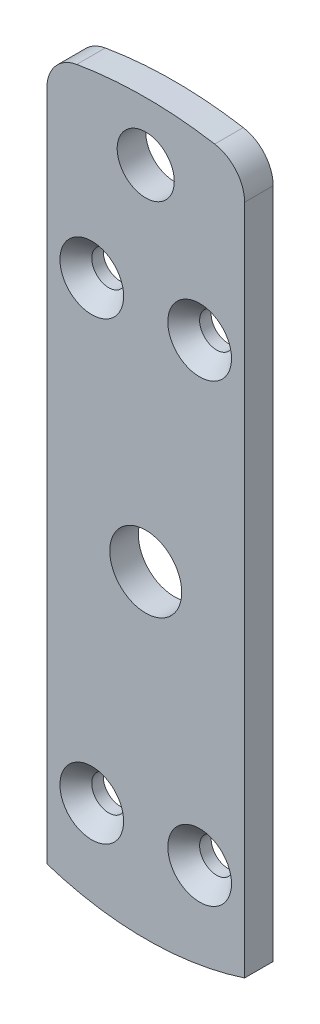
ISO-10303-21;
HEADER;
FILE_DESCRIPTION(('STEP AP214'),'2;1');
FILE_NAME('part.step','',(''),(''),'','','');
FILE_SCHEMA(('AUTOMOTIVE_DESIGN { 1 0 10303 214 1 1 1 1 }'));
ENDSEC;
DATA;
#1=APPLICATION_CONTEXT('core data for automotive mechanical design processes');
#2=APPLICATION_PROTOCOL_DEFINITION('international standard','automotive_design',2000,#1);
#3=PRODUCT_CONTEXT('',#1,'mechanical');
#4=PRODUCT('Part','Part','',(#3));
#5=PRODUCT_RELATED_PRODUCT_CATEGORY('part','',(#4));
#6=PRODUCT_DEFINITION_FORMATION('','',#4);
#7=PRODUCT_DEFINITION_CONTEXT('part definition',#1,'design');
#8=PRODUCT_DEFINITION('design','',#6,#7);
#9=PRODUCT_DEFINITION_SHAPE('','',#8);
#10=(LENGTH_UNIT() NAMED_UNIT(*) SI_UNIT(.MILLI.,.METRE.));
#11=(NAMED_UNIT(*) PLANE_ANGLE_UNIT() SI_UNIT($,.RADIAN.));
#12=(NAMED_UNIT(*) SI_UNIT($,.STERADIAN.) SOLID_ANGLE_UNIT());
#13=UNCERTAINTY_MEASURE_WITH_UNIT(LENGTH_MEASURE(1.E-05),#10,'distance_accuracy_value','');
#14=(GEOMETRIC_REPRESENTATION_CONTEXT(3) GLOBAL_UNCERTAINTY_ASSIGNED_CONTEXT((#13)) GLOBAL_UNIT_ASSIGNED_CONTEXT((#10,
#11,#12)) REPRESENTATION_CONTEXT('',''));
#15=CARTESIAN_POINT('',(0.,0.,0.));
#16=DIRECTION('',(0.,0.,1.));
#17=DIRECTION('',(1.,0.,0.));
#18=AXIS2_PLACEMENT_3D('',#15,#16,#17);
#19=CARTESIAN_POINT('',(-2.01611012931301E-13,0.,3.175));
#20=DIRECTION('',(0.,0.,-1.));
#21=DIRECTION('',(-1.,0.,0.));
#22=AXIS2_PLACEMENT_3D('',#19,#20,#21);
#23=PLANE('',#22);
#24=CARTESIAN_POINT('',(-5.99999999999998,25.2982212813471,3.175));
#25=DIRECTION('',(0.,0.,1.));
#26=DIRECTION('',(1.,0.,0.));
#27=AXIS2_PLACEMENT_3D('',#24,#25,#26);
#28=CIRCLE('',#27,3.5433);
#29=CARTESIAN_POINT('',(-2.45669999999998,25.2982212813471,3.175));
#30=VERTEX_POINT('',#29);
#31=EDGE_CURVE('E232',#30,#30,#28,.T.);
#32=ORIENTED_EDGE('',*,*,#31,.F.);
#33=EDGE_LOOP('',(#32));
#34=FACE_BOUND('',#33,.T.);
#35=CARTESIAN_POINT('',(-5.99999999999998,-25.2982212813471,3.175));
#36=DIRECTION('',(0.,0.,1.));
#37=DIRECTION('',(1.,0.,0.));
#38=AXIS2_PLACEMENT_3D('',#35,#36,#37);
#39=CIRCLE('',#38,3.5433);
#40=CARTESIAN_POINT('',(-2.45669999999998,-25.2982212813471,3.175));
#41=VERTEX_POINT('',#40);
#42=EDGE_CURVE('E145',#41,#41,#39,.T.);
#43=ORIENTED_EDGE('',*,*,#42,.F.);
#44=EDGE_LOOP('',(#43));
#45=FACE_BOUND('',#44,.T.);
#46=CARTESIAN_POINT('',(5.99999999999998,25.2982212813471,3.175));
#47=DIRECTION('',(0.,0.,1.));
#48=DIRECTION('',(1.,0.,0.));
#49=AXIS2_PLACEMENT_3D('',#46,#47,#48);
#50=CIRCLE('',#49,3.5433);
#51=CARTESIAN_POINT('',(9.54329999999998,25.2982212813471,3.175));
#52=VERTEX_POINT('',#51);
#53=EDGE_CURVE('E140',#52,#52,#50,.T.);
#54=ORIENTED_EDGE('',*,*,#53,.F.);
#55=EDGE_LOOP('',(#54));
#56=FACE_BOUND('',#55,.T.);
#57=CARTESIAN_POINT('',(5.99999999999998,-25.2982212813471,3.175));
#58=DIRECTION('',(0.,0.,1.));
#59=DIRECTION('',(1.,0.,0.));
#60=AXIS2_PLACEMENT_3D('',#57,#58,#59);
#61=CIRCLE('',#60,3.5433);
#62=CARTESIAN_POINT('',(9.54329999999998,-25.2982212813471,3.175));
#63=VERTEX_POINT('',#62);
#64=EDGE_CURVE('E135',#63,#63,#61,.T.);
#65=ORIENTED_EDGE('',*,*,#64,.F.);
#66=EDGE_LOOP('',(#65));
#67=FACE_BOUND('',#66,.T.);
#68=CARTESIAN_POINT('',(-2.01611012931301E-13,0.,3.175));
#69=DIRECTION('',(0.,0.,1.));
#70=DIRECTION('',(-1.,0.,0.));
#71=AXIS2_PLACEMENT_3D('',#68,#69,#70);
#72=CIRCLE('',#71,45.675);
#73=CARTESIAN_POINT('',(7.67186562687485,45.0260824723091,3.175));
#74=VERTEX_POINT('',#73);
#75=CARTESIAN_POINT('',(-7.67186562687481,45.0260824723091,3.175));
#76=VERTEX_POINT('',#75);
#77=EDGE_CURVE('E99',#74,#76,#72,.T.);
#78=ORIENTED_EDGE('',*,*,#77,.T.);
#79=CARTESIAN_POINT('',(-7.00000000000019,41.0829115935081,3.175));
#80=DIRECTION('',(0.,0.,-1.));
#81=DIRECTION('',(-1.,0.,0.));
#82=AXIS2_PLACEMENT_3D('',#79,#80,#81);
#83=CIRCLE('',#82,4.);
#84=CARTESIAN_POINT('',(-11.0000000000002,41.0829115935081,3.175));
#85=VERTEX_POINT('',#84);
#86=EDGE_CURVE('E43',#76,#85,#83,.F.);
#87=ORIENTED_EDGE('',*,*,#86,.T.);
#88=DIRECTION('',(0.,-1.,0.));
#89=VECTOR('',#88,1.);
#90=CARTESIAN_POINT('',(-11.0000000000002,-33.6475853517009,3.175));
#91=LINE('',#90,#89);
#92=CARTESIAN_POINT('',(-11.0000000000002,-33.647585351701,3.175));
#93=VERTEX_POINT('',#92);
#94=EDGE_CURVE('E89',#85,#93,#91,.T.);
#95=ORIENTED_EDGE('',*,*,#94,.T.);
#96=CARTESIAN_POINT('',(-2.01611012931301E-13,0.,3.175));
#97=DIRECTION('',(0.,0.,1.));
#98=DIRECTION('',(1.,0.,0.));
#99=AXIS2_PLACEMENT_3D('',#96,#97,#98);
#100=CIRCLE('',#99,35.4000000000001);
#101=CARTESIAN_POINT('',(11.0000000000002,-33.6475853517009,3.175));
#102=VERTEX_POINT('',#101);
#103=EDGE_CURVE('E93',#93,#102,#100,.T.);
#104=ORIENTED_EDGE('',*,*,#103,.T.);
#105=DIRECTION('',(0.,1.,0.));
#106=VECTOR('',#105,1.);
#107=CARTESIAN_POINT('',(11.0000000000002,44.3306397991276,3.175));
#108=LINE('',#107,#106);
#109=CARTESIAN_POINT('',(11.0000000000002,41.082911593508,3.175));
#110=VERTEX_POINT('',#109);
#111=EDGE_CURVE('E113',#102,#110,#108,.T.);
#112=ORIENTED_EDGE('',*,*,#111,.T.);
#113=CARTESIAN_POINT('',(7.00000000000019,41.082911593508,3.175));
#114=DIRECTION('',(0.,0.,-1.));
#115=DIRECTION('',(-1.,0.,0.));
#116=AXIS2_PLACEMENT_3D('',#113,#114,#115);
#117=CIRCLE('',#116,4.);
#118=EDGE_CURVE('E156',#110,#74,#117,.F.);
#119=ORIENTED_EDGE('',*,*,#118,.T.);
#120=EDGE_LOOP('',(#78,#87,#95,#104,#112,#119));
#121=FACE_BOUND('',#120,.T.);
#122=CARTESIAN_POINT('',(-2.01611012931301E-13,0.,3.175));
#123=DIRECTION('',(0.,0.,1.));
#124=DIRECTION('',(1.,0.,0.));
#125=AXIS2_PLACEMENT_3D('',#122,#123,#124);
#126=CIRCLE('',#125,4.);
#127=CARTESIAN_POINT('',(3.9999999999998,0.,3.175));
#128=VERTEX_POINT('',#127);
#129=EDGE_CURVE('E120',#128,#128,#126,.T.);
#130=ORIENTED_EDGE('',*,*,#129,.F.);
#131=EDGE_LOOP('',(#130));
#132=FACE_BOUND('',#131,.T.);
#133=CARTESIAN_POINT('',(0.,39.175,3.175));
#134=DIRECTION('',(0.,0.,1.));
#135=DIRECTION('',(1.,0.,0.));
#136=AXIS2_PLACEMENT_3D('',#133,#134,#135);
#137=CIRCLE('',#136,3.175);
#138=CARTESIAN_POINT('',(3.175,39.175,3.175));
#139=VERTEX_POINT('',#138);
#140=EDGE_CURVE('E248',#139,#139,#137,.T.);
#141=ORIENTED_EDGE('',*,*,#140,.F.);
#142=EDGE_LOOP('',(#141));
#143=FACE_BOUND('',#142,.T.);
#144=ADVANCED_FACE('F35',(#34,#45,#56,#67,#121,#132,#143),#23,.F.);
#145=CARTESIAN_POINT('',(-2.01611012931301E-13,0.,0.));
#146=DIRECTION('',(0.,0.,-1.));
#147=DIRECTION('',(-1.,0.,0.));
#148=AXIS2_PLACEMENT_3D('',#145,#146,#147);
#149=PLANE('',#148);
#150=CARTESIAN_POINT('',(-5.99999999999998,25.2982212813471,0.));
#151=DIRECTION('',(0.,0.,-1.));
#152=DIRECTION('',(-1.,0.,0.));
#153=AXIS2_PLACEMENT_3D('',#150,#151,#152);
#154=CIRCLE('',#153,1.89865);
#155=CARTESIAN_POINT('',(-7.89864999999997,25.2982212813471,0.));
#156=VERTEX_POINT('',#155);
#157=EDGE_CURVE('E142',#156,#156,#154,.T.);
#158=ORIENTED_EDGE('',*,*,#157,.F.);
#159=EDGE_LOOP('',(#158));
#160=FACE_BOUND('',#159,.T.);
#161=CARTESIAN_POINT('',(-5.99999999999998,-25.2982212813471,0.));
#162=DIRECTION('',(0.,0.,-1.));
#163=DIRECTION('',(-1.,0.,0.));
#164=AXIS2_PLACEMENT_3D('',#161,#162,#163);
#165=CIRCLE('',#164,1.89865);
#166=CARTESIAN_POINT('',(-7.89864999999997,-25.2982212813471,0.));
#167=VERTEX_POINT('',#166);
#168=EDGE_CURVE('E137',#167,#167,#165,.T.);
#169=ORIENTED_EDGE('',*,*,#168,.F.);
#170=EDGE_LOOP('',(#169));
#171=FACE_BOUND('',#170,.T.);
#172=CARTESIAN_POINT('',(5.99999999999998,25.2982212813471,0.));
#173=DIRECTION('',(0.,0.,-1.));
#174=DIRECTION('',(-1.,0.,0.));
#175=AXIS2_PLACEMENT_3D('',#172,#173,#174);
#176=CIRCLE('',#175,1.89865);
#177=CARTESIAN_POINT('',(4.10134999999998,25.2982212813471,0.));
#178=VERTEX_POINT('',#177);
#179=EDGE_CURVE('E132',#178,#178,#176,.T.);
#180=ORIENTED_EDGE('',*,*,#179,.F.);
#181=EDGE_LOOP('',(#180));
#182=FACE_BOUND('',#181,.T.);
#183=CARTESIAN_POINT('',(5.99999999999998,-25.2982212813471,0.));
#184=DIRECTION('',(0.,0.,-1.));
#185=DIRECTION('',(-1.,0.,0.));
#186=AXIS2_PLACEMENT_3D('',#183,#184,#185);
#187=CIRCLE('',#186,1.89865);
#188=CARTESIAN_POINT('',(4.10134999999998,-25.2982212813471,0.));
#189=VERTEX_POINT('',#188);
#190=EDGE_CURVE('E127',#189,#189,#187,.T.);
#191=ORIENTED_EDGE('',*,*,#190,.F.);
#192=EDGE_LOOP('',(#191));
#193=FACE_BOUND('',#192,.T.);
#194=CARTESIAN_POINT('',(-2.01611012931301E-13,0.,0.));
#195=DIRECTION('',(0.,0.,1.));
#196=DIRECTION('',(1.,0.,0.));
#197=AXIS2_PLACEMENT_3D('',#194,#195,#196);
#198=CIRCLE('',#197,4.);
#199=CARTESIAN_POINT('',(3.9999999999998,0.,0.));
#200=VERTEX_POINT('',#199);
#201=EDGE_CURVE('E251',#200,#200,#198,.T.);
#202=ORIENTED_EDGE('',*,*,#201,.T.);
#203=EDGE_LOOP('',(#202));
#204=FACE_BOUND('',#203,.T.);
#205=DIRECTION('',(0.,-1.,0.));
#206=VECTOR('',#205,1.);
#207=CARTESIAN_POINT('',(-11.0000000000002,-33.6475853517009,0.));
#208=LINE('',#207,#206);
#209=CARTESIAN_POINT('',(-11.0000000000002,41.0829115935081,0.));
#210=VERTEX_POINT('',#209);
#211=CARTESIAN_POINT('',(-11.0000000000002,-33.647585351701,0.));
#212=VERTEX_POINT('',#211);
#213=EDGE_CURVE('E105',#210,#212,#208,.T.);
#214=ORIENTED_EDGE('',*,*,#213,.F.);
#215=CARTESIAN_POINT('',(-7.00000000000019,41.0829115935081,0.));
#216=DIRECTION('',(0.,0.,-1.));
#217=DIRECTION('',(-1.,0.,0.));
#218=AXIS2_PLACEMENT_3D('',#215,#216,#217);
#219=CIRCLE('',#218,4.);
#220=CARTESIAN_POINT('',(-7.67186562687481,45.0260824723091,0.));
#221=VERTEX_POINT('',#220);
#222=EDGE_CURVE('E150',#210,#221,#219,.T.);
#223=ORIENTED_EDGE('',*,*,#222,.T.);
#224=CARTESIAN_POINT('',(-2.01611012931301E-13,0.,0.));
#225=DIRECTION('',(0.,0.,1.));
#226=DIRECTION('',(-1.,0.,0.));
#227=AXIS2_PLACEMENT_3D('',#224,#225,#226);
#228=CIRCLE('',#227,45.675);
#229=CARTESIAN_POINT('',(7.67186562687485,45.0260824723091,0.));
#230=VERTEX_POINT('',#229);
#231=EDGE_CURVE('E118',#230,#221,#228,.T.);
#232=ORIENTED_EDGE('',*,*,#231,.F.);
#233=CARTESIAN_POINT('',(7.00000000000019,41.082911593508,0.));
#234=DIRECTION('',(0.,0.,-1.));
#235=DIRECTION('',(-1.,0.,0.));
#236=AXIS2_PLACEMENT_3D('',#233,#234,#235);
#237=CIRCLE('',#236,4.);
#238=CARTESIAN_POINT('',(11.0000000000002,41.082911593508,0.));
#239=VERTEX_POINT('',#238);
#240=EDGE_CURVE('E148',#230,#239,#237,.T.);
#241=ORIENTED_EDGE('',*,*,#240,.T.);
#242=DIRECTION('',(0.,1.,0.));
#243=VECTOR('',#242,1.);
#244=CARTESIAN_POINT('',(11.0000000000002,44.3306397991276,0.));
#245=LINE('',#244,#243);
#246=CARTESIAN_POINT('',(11.0000000000002,-33.6475853517009,0.));
#247=VERTEX_POINT('',#246);
#248=EDGE_CURVE('E124',#247,#239,#245,.T.);
#249=ORIENTED_EDGE('',*,*,#248,.F.);
#250=CARTESIAN_POINT('',(-2.01611012931301E-13,0.,0.));
#251=DIRECTION('',(0.,0.,1.));
#252=DIRECTION('',(1.,0.,0.));
#253=AXIS2_PLACEMENT_3D('',#250,#251,#252);
#254=CIRCLE('',#253,35.4000000000001);
#255=EDGE_CURVE('E122',#212,#247,#254,.T.);
#256=ORIENTED_EDGE('',*,*,#255,.F.);
#257=EDGE_LOOP('',(#214,#223,#232,#241,#249,#256));
#258=FACE_BOUND('',#257,.T.);
#259=CARTESIAN_POINT('',(0.,39.175,0.));
#260=DIRECTION('',(0.,0.,1.));
#261=DIRECTION('',(1.,0.,0.));
#262=AXIS2_PLACEMENT_3D('',#259,#260,#261);
#263=CIRCLE('',#262,3.175);
#264=CARTESIAN_POINT('',(3.175,39.175,0.));
#265=VERTEX_POINT('',#264);
#266=EDGE_CURVE('E130',#265,#265,#263,.T.);
#267=ORIENTED_EDGE('',*,*,#266,.T.);
#268=EDGE_LOOP('',(#267));
#269=FACE_BOUND('',#268,.T.);
#270=ADVANCED_FACE('F164',(#160,#171,#182,#193,#204,#258,#269),#149,.T.);
#271=CARTESIAN_POINT('',(-2.01611012931301E-13,0.,3.175));
#272=DIRECTION('',(0.,0.,-1.));
#273=DIRECTION('',(-1.,0.,0.));
#274=AXIS2_PLACEMENT_3D('',#271,#272,#273);
#275=CYLINDRICAL_SURFACE('',#274,45.675);
#276=ORIENTED_EDGE('',*,*,#231,.T.);
#277=DIRECTION('',(0.,0.,-1.));
#278=VECTOR('',#277,1.);
#279=CARTESIAN_POINT('',(-7.67186562687481,45.0260824723091,3.175));
#280=LINE('',#279,#278);
#281=EDGE_CURVE('E56',#221,#76,#280,.F.);
#282=ORIENTED_EDGE('',*,*,#281,.T.);
#283=ORIENTED_EDGE('',*,*,#77,.F.);
#284=DIRECTION('',(0.,0.,-1.));
#285=VECTOR('',#284,1.);
#286=CARTESIAN_POINT('',(7.67186562687485,45.0260824723091,3.175));
#287=LINE('',#286,#285);
#288=EDGE_CURVE('E152',#74,#230,#287,.T.);
#289=ORIENTED_EDGE('',*,*,#288,.T.);
#290=EDGE_LOOP('',(#276,#282,#283,#289));
#291=FACE_BOUND('',#290,.T.);
#292=ADVANCED_FACE('F160',(#291),#275,.T.);
#293=CARTESIAN_POINT('',(-11.0000000000002,-33.6475853517009,3.175));
#294=DIRECTION('',(1.,0.,0.));
#295=DIRECTION('',(0.,0.,-1.));
#296=AXIS2_PLACEMENT_3D('',#293,#294,#295);
#297=PLANE('',#296);
#298=ORIENTED_EDGE('',*,*,#94,.F.);
#299=DIRECTION('',(0.,0.,-1.));
#300=VECTOR('',#299,1.);
#301=CARTESIAN_POINT('',(-11.0000000000002,41.0829115935081,3.175));
#302=LINE('',#301,#300);
#303=EDGE_CURVE('E108',#85,#210,#302,.T.);
#304=ORIENTED_EDGE('',*,*,#303,.T.);
#305=ORIENTED_EDGE('',*,*,#213,.T.);
#306=DIRECTION('',(0.,0.,-1.));
#307=VECTOR('',#306,1.);
#308=CARTESIAN_POINT('',(-11.0000000000002,-33.647585351701,3.175));
#309=LINE('',#308,#307);
#310=EDGE_CURVE('E102',#93,#212,#309,.T.);
#311=ORIENTED_EDGE('',*,*,#310,.F.);
#312=EDGE_LOOP('',(#298,#304,#305,#311));
#313=FACE_BOUND('',#312,.T.);
#314=ADVANCED_FACE('F103',(#313),#297,.F.);
#315=CARTESIAN_POINT('',(-2.01611012931301E-13,0.,3.175));
#316=DIRECTION('',(0.,0.,-1.));
#317=DIRECTION('',(-1.,0.,0.));
#318=AXIS2_PLACEMENT_3D('',#315,#316,#317);
#319=CYLINDRICAL_SURFACE('',#318,35.4000000000001);
#320=ORIENTED_EDGE('',*,*,#255,.T.);
#321=DIRECTION('',(0.,0.,-1.));
#322=VECTOR('',#321,1.);
#323=CARTESIAN_POINT('',(11.0000000000002,-33.6475853517009,3.175));
#324=LINE('',#323,#322);
#325=EDGE_CURVE('E109',#102,#247,#324,.T.);
#326=ORIENTED_EDGE('',*,*,#325,.F.);
#327=ORIENTED_EDGE('',*,*,#103,.F.);
#328=ORIENTED_EDGE('',*,*,#310,.T.);
#329=EDGE_LOOP('',(#320,#326,#327,#328));
#330=FACE_BOUND('',#329,.T.);
#331=ADVANCED_FACE('F111',(#330),#319,.T.);
#332=CARTESIAN_POINT('',(11.0000000000002,44.3306397991276,3.175));
#333=DIRECTION('',(-1.,0.,0.));
#334=DIRECTION('',(0.,0.,1.));
#335=AXIS2_PLACEMENT_3D('',#332,#333,#334);
#336=PLANE('',#335);
#337=ORIENTED_EDGE('',*,*,#248,.T.);
#338=DIRECTION('',(0.,0.,-1.));
#339=VECTOR('',#338,1.);
#340=CARTESIAN_POINT('',(11.0000000000002,41.082911593508,3.175));
#341=LINE('',#340,#339);
#342=EDGE_CURVE('E11',#239,#110,#341,.F.);
#343=ORIENTED_EDGE('',*,*,#342,.T.);
#344=ORIENTED_EDGE('',*,*,#111,.F.);
#345=ORIENTED_EDGE('',*,*,#325,.T.);
#346=EDGE_LOOP('',(#337,#343,#344,#345));
#347=FACE_BOUND('',#346,.T.);
#348=ADVANCED_FACE('F166',(#347),#336,.F.);
#349=CARTESIAN_POINT('',(-2.01611012931301E-13,0.,3.175));
#350=DIRECTION('',(0.,0.,-1.));
#351=DIRECTION('',(-1.,0.,0.));
#352=AXIS2_PLACEMENT_3D('',#349,#350,#351);
#353=CYLINDRICAL_SURFACE('',#352,4.);
#354=ORIENTED_EDGE('',*,*,#129,.T.);
#355=EDGE_LOOP('',(#354));
#356=FACE_BOUND('',#355,.T.);
#357=ORIENTED_EDGE('',*,*,#201,.F.);
#358=EDGE_LOOP('',(#357));
#359=FACE_BOUND('',#358,.T.);
#360=ADVANCED_FACE('F168',(#356,#359),#353,.F.);
#361=CARTESIAN_POINT('',(0.,39.175,3.175));
#362=DIRECTION('',(0.,0.,-1.));
#363=DIRECTION('',(-1.,0.,0.));
#364=AXIS2_PLACEMENT_3D('',#361,#362,#363);
#365=CYLINDRICAL_SURFACE('',#364,3.175);
#366=ORIENTED_EDGE('',*,*,#140,.T.);
#367=EDGE_LOOP('',(#366));
#368=FACE_BOUND('',#367,.T.);
#369=ORIENTED_EDGE('',*,*,#266,.F.);
#370=EDGE_LOOP('',(#369));
#371=FACE_BOUND('',#370,.T.);
#372=ADVANCED_FACE('F174',(#368,#371),#365,.F.);
#373=CARTESIAN_POINT('',(5.99999999999998,-25.2982212813471,3.175));
#374=DIRECTION('',(0.,0.,1.));
#375=DIRECTION('',(1.,0.,0.));
#376=AXIS2_PLACEMENT_3D('',#373,#374,#375);
#377=CYLINDRICAL_SURFACE('',#376,1.89865);
#378=ORIENTED_EDGE('',*,*,#190,.T.);
#379=EDGE_LOOP('',(#378));
#380=FACE_BOUND('',#379,.T.);
#381=CARTESIAN_POINT('',(5.99999999999998,-25.2982212813471,1.28304659906397));
#382=DIRECTION('',(0.,0.,1.));
#383=DIRECTION('',(1.,0.,0.));
#384=AXIS2_PLACEMENT_3D('',#381,#382,#383);
#385=CIRCLE('',#384,1.89865);
#386=CARTESIAN_POINT('',(7.89864999999998,-25.2982212813471,1.28304659906397));
#387=VERTEX_POINT('',#386);
#388=EDGE_CURVE('E131',#387,#387,#385,.T.);
#389=ORIENTED_EDGE('',*,*,#388,.T.);
#390=EDGE_LOOP('',(#389));
#391=FACE_BOUND('',#390,.T.);
#392=ADVANCED_FACE('F191',(#380,#391),#377,.F.);
#393=CARTESIAN_POINT('',(5.99999999999998,-25.2982212813471,3.175));
#394=DIRECTION('',(0.,0.,1.));
#395=DIRECTION('',(1.,0.,0.));
#396=AXIS2_PLACEMENT_3D('',#393,#394,#395);
#397=CONICAL_SURFACE('',#396,3.5433,0.715584993317675);
#398=ORIENTED_EDGE('',*,*,#388,.F.);
#399=EDGE_LOOP('',(#398));
#400=FACE_BOUND('',#399,.T.);
#401=ORIENTED_EDGE('',*,*,#64,.T.);
#402=EDGE_LOOP('',(#401));
#403=FACE_BOUND('',#402,.T.);
#404=ADVANCED_FACE('F195',(#400,#403),#397,.F.);
#405=CARTESIAN_POINT('',(5.99999999999998,25.2982212813471,3.175));
#406=DIRECTION('',(0.,0.,1.));
#407=DIRECTION('',(1.,0.,0.));
#408=AXIS2_PLACEMENT_3D('',#405,#406,#407);
#409=CYLINDRICAL_SURFACE('',#408,1.89865);
#410=ORIENTED_EDGE('',*,*,#179,.T.);
#411=EDGE_LOOP('',(#410));
#412=FACE_BOUND('',#411,.T.);
#413=CARTESIAN_POINT('',(5.99999999999998,25.2982212813471,1.28304659906397));
#414=DIRECTION('',(0.,0.,1.));
#415=DIRECTION('',(1.,0.,0.));
#416=AXIS2_PLACEMENT_3D('',#413,#414,#415);
#417=CIRCLE('',#416,1.89865);
#418=CARTESIAN_POINT('',(7.89864999999998,25.2982212813471,1.28304659906397));
#419=VERTEX_POINT('',#418);
#420=EDGE_CURVE('E136',#419,#419,#417,.T.);
#421=ORIENTED_EDGE('',*,*,#420,.T.);
#422=EDGE_LOOP('',(#421));
#423=FACE_BOUND('',#422,.T.);
#424=ADVANCED_FACE('F199',(#412,#423),#409,.F.);
#425=CARTESIAN_POINT('',(5.99999999999998,25.2982212813471,3.175));
#426=DIRECTION('',(0.,0.,1.));
#427=DIRECTION('',(1.,0.,0.));
#428=AXIS2_PLACEMENT_3D('',#425,#426,#427);
#429=CONICAL_SURFACE('',#428,3.5433,0.715584993317675);
#430=ORIENTED_EDGE('',*,*,#420,.F.);
#431=EDGE_LOOP('',(#430));
#432=FACE_BOUND('',#431,.T.);
#433=ORIENTED_EDGE('',*,*,#53,.T.);
#434=EDGE_LOOP('',(#433));
#435=FACE_BOUND('',#434,.T.);
#436=ADVANCED_FACE('F203',(#432,#435),#429,.F.);
#437=CARTESIAN_POINT('',(-5.99999999999998,-25.2982212813471,3.175));
#438=DIRECTION('',(0.,0.,1.));
#439=DIRECTION('',(1.,0.,0.));
#440=AXIS2_PLACEMENT_3D('',#437,#438,#439);
#441=CYLINDRICAL_SURFACE('',#440,1.89865);
#442=ORIENTED_EDGE('',*,*,#168,.T.);
#443=EDGE_LOOP('',(#442));
#444=FACE_BOUND('',#443,.T.);
#445=CARTESIAN_POINT('',(-5.99999999999998,-25.2982212813471,1.28304659906397));
#446=DIRECTION('',(0.,0.,1.));
#447=DIRECTION('',(1.,0.,0.));
#448=AXIS2_PLACEMENT_3D('',#445,#446,#447);
#449=CIRCLE('',#448,1.89865);
#450=CARTESIAN_POINT('',(-4.10134999999998,-25.2982212813471,1.28304659906397));
#451=VERTEX_POINT('',#450);
#452=EDGE_CURVE('E141',#451,#451,#449,.T.);
#453=ORIENTED_EDGE('',*,*,#452,.T.);
#454=EDGE_LOOP('',(#453));
#455=FACE_BOUND('',#454,.T.);
#456=ADVANCED_FACE('F207',(#444,#455),#441,.F.);
#457=CARTESIAN_POINT('',(-5.99999999999998,-25.2982212813471,3.175));
#458=DIRECTION('',(0.,0.,1.));
#459=DIRECTION('',(1.,0.,0.));
#460=AXIS2_PLACEMENT_3D('',#457,#458,#459);
#461=CONICAL_SURFACE('',#460,3.5433,0.715584993317675);
#462=ORIENTED_EDGE('',*,*,#452,.F.);
#463=EDGE_LOOP('',(#462));
#464=FACE_BOUND('',#463,.T.);
#465=ORIENTED_EDGE('',*,*,#42,.T.);
#466=EDGE_LOOP('',(#465));
#467=FACE_BOUND('',#466,.T.);
#468=ADVANCED_FACE('F211',(#464,#467),#461,.F.);
#469=CARTESIAN_POINT('',(-5.99999999999998,25.2982212813471,3.175));
#470=DIRECTION('',(0.,0.,1.));
#471=DIRECTION('',(1.,0.,0.));
#472=AXIS2_PLACEMENT_3D('',#469,#470,#471);
#473=CYLINDRICAL_SURFACE('',#472,1.89865);
#474=ORIENTED_EDGE('',*,*,#157,.T.);
#475=EDGE_LOOP('',(#474));
#476=FACE_BOUND('',#475,.T.);
#477=CARTESIAN_POINT('',(-5.99999999999998,25.2982212813471,1.28304659906397));
#478=DIRECTION('',(0.,0.,1.));
#479=DIRECTION('',(1.,0.,0.));
#480=AXIS2_PLACEMENT_3D('',#477,#478,#479);
#481=CIRCLE('',#480,1.89865);
#482=CARTESIAN_POINT('',(-4.10134999999998,25.2982212813471,1.28304659906397));
#483=VERTEX_POINT('',#482);
#484=EDGE_CURVE('E146',#483,#483,#481,.T.);
#485=ORIENTED_EDGE('',*,*,#484,.T.);
#486=EDGE_LOOP('',(#485));
#487=FACE_BOUND('',#486,.T.);
#488=ADVANCED_FACE('F215',(#476,#487),#473,.F.);
#489=CARTESIAN_POINT('',(-5.99999999999998,25.2982212813471,3.175));
#490=DIRECTION('',(0.,0.,1.));
#491=DIRECTION('',(1.,0.,0.));
#492=AXIS2_PLACEMENT_3D('',#489,#490,#491);
#493=CONICAL_SURFACE('',#492,3.5433,0.715584993317675);
#494=ORIENTED_EDGE('',*,*,#484,.F.);
#495=EDGE_LOOP('',(#494));
#496=FACE_BOUND('',#495,.T.);
#497=ORIENTED_EDGE('',*,*,#31,.T.);
#498=EDGE_LOOP('',(#497));
#499=FACE_BOUND('',#498,.T.);
#500=ADVANCED_FACE('F219',(#496,#499),#493,.F.);
#501=CARTESIAN_POINT('',(-7.00000000000019,41.0829115935081,3.175));
#502=DIRECTION('',(0.,0.,-1.));
#503=DIRECTION('',(-1.,0.,0.));
#504=AXIS2_PLACEMENT_3D('',#501,#502,#503);
#505=CYLINDRICAL_SURFACE('',#504,4.);
#506=ORIENTED_EDGE('',*,*,#86,.F.);
#507=ORIENTED_EDGE('',*,*,#281,.F.);
#508=ORIENTED_EDGE('',*,*,#222,.F.);
#509=ORIENTED_EDGE('',*,*,#303,.F.);
#510=EDGE_LOOP('',(#506,#507,#508,#509));
#511=FACE_BOUND('',#510,.T.);
#512=ADVANCED_FACE('F222',(#511),#505,.T.);
#513=CARTESIAN_POINT('',(7.00000000000019,41.082911593508,3.175));
#514=DIRECTION('',(0.,0.,-1.));
#515=DIRECTION('',(-1.,0.,0.));
#516=AXIS2_PLACEMENT_3D('',#513,#514,#515);
#517=CYLINDRICAL_SURFACE('',#516,4.);
#518=ORIENTED_EDGE('',*,*,#118,.F.);
#519=ORIENTED_EDGE('',*,*,#342,.F.);
#520=ORIENTED_EDGE('',*,*,#240,.F.);
#521=ORIENTED_EDGE('',*,*,#288,.F.);
#522=EDGE_LOOP('',(#518,#519,#520,#521));
#523=FACE_BOUND('',#522,.T.);
#524=ADVANCED_FACE('F37',(#523),#517,.T.);
#525=CLOSED_SHELL('',(#144,#270,#292,#314,#331,#348,#360,#372,#392,#404,#424,#436,#456,#468,
#488,#500,#512,#524));
#526=MANIFOLD_SOLID_BREP('B2',#525);
#527=ADVANCED_BREP_SHAPE_REPRESENTATION('',(#18,#526),#14);
#528=SHAPE_DEFINITION_REPRESENTATION(#9,#527);
ENDSEC;
END-ISO-10303-21;
